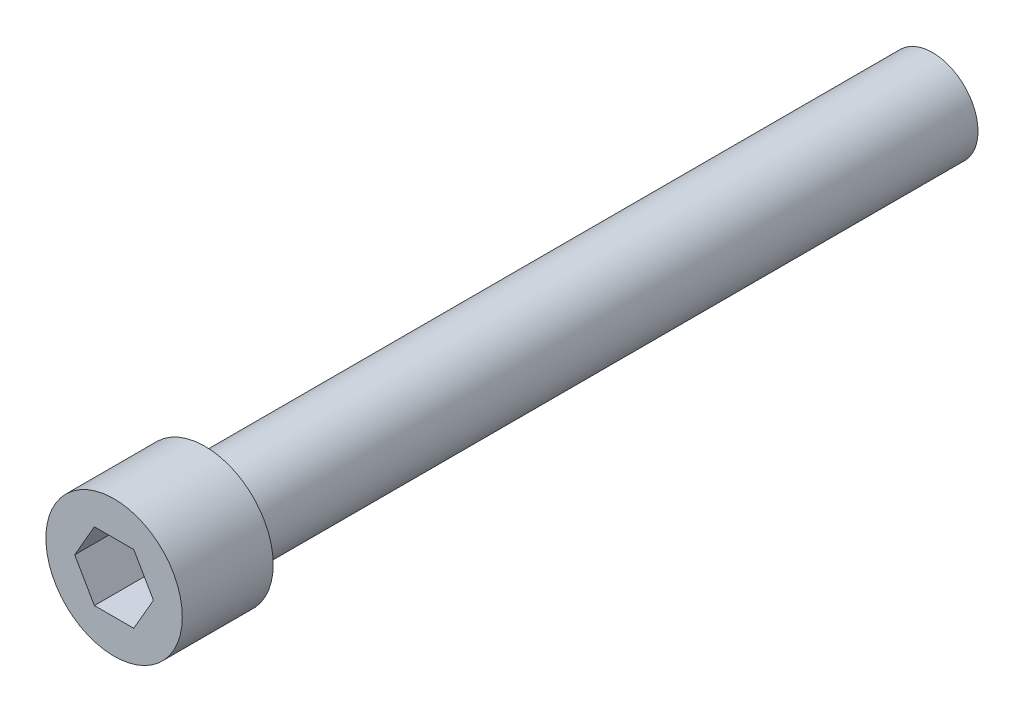
ISO-10303-21;
HEADER;
FILE_DESCRIPTION(('STEP AP214'),'2;1');
FILE_NAME('part.step','',(''),(''),'','','');
FILE_SCHEMA(('AUTOMOTIVE_DESIGN { 1 0 10303 214 1 1 1 1 }'));
ENDSEC;
DATA;
#1=APPLICATION_CONTEXT('core data for automotive mechanical design processes');
#2=APPLICATION_PROTOCOL_DEFINITION('international standard','automotive_design',2000,#1);
#3=PRODUCT_CONTEXT('',#1,'mechanical');
#4=PRODUCT('Part','Part','',(#3));
#5=PRODUCT_RELATED_PRODUCT_CATEGORY('part','',(#4));
#6=PRODUCT_DEFINITION_FORMATION('','',#4);
#7=PRODUCT_DEFINITION_CONTEXT('part definition',#1,'design');
#8=PRODUCT_DEFINITION('design','',#6,#7);
#9=PRODUCT_DEFINITION_SHAPE('','',#8);
#10=(LENGTH_UNIT() NAMED_UNIT(*) SI_UNIT(.MILLI.,.METRE.));
#11=(NAMED_UNIT(*) PLANE_ANGLE_UNIT() SI_UNIT($,.RADIAN.));
#12=(NAMED_UNIT(*) SI_UNIT($,.STERADIAN.) SOLID_ANGLE_UNIT());
#13=UNCERTAINTY_MEASURE_WITH_UNIT(LENGTH_MEASURE(1.E-05),#10,'distance_accuracy_value','');
#14=(GEOMETRIC_REPRESENTATION_CONTEXT(3) GLOBAL_UNCERTAINTY_ASSIGNED_CONTEXT((#13)) GLOBAL_UNIT_ASSIGNED_CONTEXT((#10,
#11,#12)) REPRESENTATION_CONTEXT('',''));
#15=CARTESIAN_POINT('',(0.,0.,0.));
#16=DIRECTION('',(0.,0.,1.));
#17=DIRECTION('',(1.,0.,0.));
#18=AXIS2_PLACEMENT_3D('',#15,#16,#17);
#19=CARTESIAN_POINT('',(0.,0.,50.8));
#20=DIRECTION('',(0.,0.,-1.));
#21=DIRECTION('',(-1.,0.,0.));
#22=AXIS2_PLACEMENT_3D('',#19,#20,#21);
#23=CYLINDRICAL_SURFACE('',#22,3.175);
#24=CARTESIAN_POINT('',(0.,0.,50.8));
#25=DIRECTION('',(0.,0.,1.));
#26=DIRECTION('',(1.,0.,0.));
#27=AXIS2_PLACEMENT_3D('',#24,#25,#26);
#28=CIRCLE('',#27,3.175);
#29=CARTESIAN_POINT('',(3.175,0.,50.8));
#30=VERTEX_POINT('',#29);
#31=EDGE_CURVE('E11',#30,#30,#28,.T.);
#32=ORIENTED_EDGE('',*,*,#31,.F.);
#33=EDGE_LOOP('',(#32));
#34=FACE_BOUND('',#33,.T.);
#35=CARTESIAN_POINT('',(0.,0.,0.));
#36=DIRECTION('',(0.,0.,1.));
#37=DIRECTION('',(1.,0.,0.));
#38=AXIS2_PLACEMENT_3D('',#35,#36,#37);
#39=CIRCLE('',#38,3.175);
#40=CARTESIAN_POINT('',(3.175,0.,0.));
#41=VERTEX_POINT('',#40);
#42=EDGE_CURVE('E36',#41,#41,#39,.T.);
#43=ORIENTED_EDGE('',*,*,#42,.T.);
#44=EDGE_LOOP('',(#43));
#45=FACE_BOUND('',#44,.T.);
#46=ADVANCED_FACE('F33',(#34,#45),#23,.T.);
#47=CARTESIAN_POINT('',(0.,0.,0.));
#48=DIRECTION('',(0.,0.,1.));
#49=DIRECTION('',(1.,0.,0.));
#50=AXIS2_PLACEMENT_3D('',#47,#48,#49);
#51=PLANE('',#50);
#52=ORIENTED_EDGE('',*,*,#42,.F.);
#53=EDGE_LOOP('',(#52));
#54=FACE_BOUND('',#53,.T.);
#55=ADVANCED_FACE('F151',(#54),#51,.F.);
#56=CARTESIAN_POINT('',(0.,0.,50.8));
#57=DIRECTION('',(0.,0.,1.));
#58=DIRECTION('',(1.,0.,0.));
#59=AXIS2_PLACEMENT_3D('',#56,#57,#58);
#60=PLANE('',#59);
#61=CARTESIAN_POINT('',(0.,0.,50.8));
#62=DIRECTION('',(0.,0.,1.));
#63=DIRECTION('',(1.,0.,0.));
#64=AXIS2_PLACEMENT_3D('',#61,#62,#63);
#65=CIRCLE('',#64,4.7625);
#66=CARTESIAN_POINT('',(4.7625,0.,50.8));
#67=VERTEX_POINT('',#66);
#68=EDGE_CURVE('E134',#67,#67,#65,.T.);
#69=ORIENTED_EDGE('',*,*,#68,.F.);
#70=EDGE_LOOP('',(#69));
#71=FACE_BOUND('',#70,.T.);
#72=ORIENTED_EDGE('',*,*,#31,.T.);
#73=EDGE_LOOP('',(#72));
#74=FACE_BOUND('',#73,.T.);
#75=ADVANCED_FACE('F148',(#71,#74),#60,.F.);
#76=CARTESIAN_POINT('',(0.,0.,57.15));
#77=DIRECTION('',(0.,0.,-1.));
#78=DIRECTION('',(-1.,0.,0.));
#79=AXIS2_PLACEMENT_3D('',#76,#77,#78);
#80=CYLINDRICAL_SURFACE('',#79,4.7625);
#81=CARTESIAN_POINT('',(0.,0.,57.15));
#82=DIRECTION('',(0.,0.,1.));
#83=DIRECTION('',(1.,0.,0.));
#84=AXIS2_PLACEMENT_3D('',#81,#82,#83);
#85=CIRCLE('',#84,4.7625);
#86=CARTESIAN_POINT('',(4.7625,0.,57.15));
#87=VERTEX_POINT('',#86);
#88=EDGE_CURVE('E140',#87,#87,#85,.T.);
#89=ORIENTED_EDGE('',*,*,#88,.F.);
#90=EDGE_LOOP('',(#89));
#91=FACE_BOUND('',#90,.T.);
#92=ORIENTED_EDGE('',*,*,#68,.T.);
#93=EDGE_LOOP('',(#92));
#94=FACE_BOUND('',#93,.T.);
#95=ADVANCED_FACE('F146',(#91,#94),#80,.T.);
#96=CARTESIAN_POINT('',(0.,0.,57.15));
#97=DIRECTION('',(0.,0.,1.));
#98=DIRECTION('',(1.,0.,0.));
#99=AXIS2_PLACEMENT_3D('',#96,#97,#98);
#100=PLANE('',#99);
#101=DIRECTION('',(0.5,0.866025403784439,0.));
#102=VECTOR('',#101,1.);
#103=CARTESIAN_POINT('',(1.3748153285078,-2.38125,57.15));
#104=LINE('',#103,#102);
#105=CARTESIAN_POINT('',(1.3748153285078,-2.38125,57.15));
#106=VERTEX_POINT('',#105);
#107=CARTESIAN_POINT('',(2.74963065701559,0.,57.15));
#108=VERTEX_POINT('',#107);
#109=EDGE_CURVE('E47',#106,#108,#104,.T.);
#110=ORIENTED_EDGE('',*,*,#109,.F.);
#111=DIRECTION('',(1.,0.,0.));
#112=VECTOR('',#111,1.);
#113=CARTESIAN_POINT('',(-1.3748153285078,-2.38125,57.15));
#114=LINE('',#113,#112);
#115=CARTESIAN_POINT('',(-1.3748153285078,-2.38125,57.15));
#116=VERTEX_POINT('',#115);
#117=EDGE_CURVE('E130',#116,#106,#114,.T.);
#118=ORIENTED_EDGE('',*,*,#117,.F.);
#119=DIRECTION('',(0.5,-0.866025403784439,0.));
#120=VECTOR('',#119,1.);
#121=CARTESIAN_POINT('',(-2.74963065701559,0.,57.15));
#122=LINE('',#121,#120);
#123=CARTESIAN_POINT('',(-2.74963065701559,0.,57.15));
#124=VERTEX_POINT('',#123);
#125=EDGE_CURVE('E128',#124,#116,#122,.T.);
#126=ORIENTED_EDGE('',*,*,#125,.F.);
#127=DIRECTION('',(-0.5,-0.866025403784439,0.));
#128=VECTOR('',#127,1.);
#129=CARTESIAN_POINT('',(-1.3748153285078,2.38125,57.15));
#130=LINE('',#129,#128);
#131=CARTESIAN_POINT('',(-1.3748153285078,2.38125,57.15));
#132=VERTEX_POINT('',#131);
#133=EDGE_CURVE('E95',#132,#124,#130,.T.);
#134=ORIENTED_EDGE('',*,*,#133,.F.);
#135=DIRECTION('',(-1.,0.,0.));
#136=VECTOR('',#135,1.);
#137=CARTESIAN_POINT('',(1.3748153285078,2.38125,57.15));
#138=LINE('',#137,#136);
#139=CARTESIAN_POINT('',(1.3748153285078,2.38125,57.15));
#140=VERTEX_POINT('',#139);
#141=EDGE_CURVE('E124',#140,#132,#138,.T.);
#142=ORIENTED_EDGE('',*,*,#141,.F.);
#143=DIRECTION('',(-0.5,0.866025403784439,0.));
#144=VECTOR('',#143,1.);
#145=CARTESIAN_POINT('',(2.74963065701559,0.,57.15));
#146=LINE('',#145,#144);
#147=EDGE_CURVE('E121',#108,#140,#146,.T.);
#148=ORIENTED_EDGE('',*,*,#147,.F.);
#149=EDGE_LOOP('',(#110,#118,#126,#134,#142,#148));
#150=FACE_BOUND('',#149,.T.);
#151=ORIENTED_EDGE('',*,*,#88,.T.);
#152=EDGE_LOOP('',(#151));
#153=FACE_BOUND('',#152,.T.);
#154=ADVANCED_FACE('F165',(#150,#153),#100,.T.);
#155=CARTESIAN_POINT('',(1.3748153285078,-2.38125,53.5686));
#156=DIRECTION('',(0.866025403784439,-0.5,0.));
#157=DIRECTION('',(0.5,0.866025403784439,0.));
#158=AXIS2_PLACEMENT_3D('',#155,#156,#157);
#159=PLANE('',#158);
#160=ORIENTED_EDGE('',*,*,#109,.T.);
#161=DIRECTION('',(0.,0.,1.));
#162=VECTOR('',#161,1.);
#163=CARTESIAN_POINT('',(2.74963065701559,0.,53.5686));
#164=LINE('',#163,#162);
#165=CARTESIAN_POINT('',(2.74963065701559,0.,53.5686));
#166=VERTEX_POINT('',#165);
#167=EDGE_CURVE('E77',#166,#108,#164,.T.);
#168=ORIENTED_EDGE('',*,*,#167,.F.);
#169=DIRECTION('',(0.5,0.866025403784439,0.));
#170=VECTOR('',#169,1.);
#171=CARTESIAN_POINT('',(1.3748153285078,-2.38125,53.5686));
#172=LINE('',#171,#170);
#173=CARTESIAN_POINT('',(1.3748153285078,-2.38125,53.5686));
#174=VERTEX_POINT('',#173);
#175=EDGE_CURVE('E132',#174,#166,#172,.T.);
#176=ORIENTED_EDGE('',*,*,#175,.F.);
#177=DIRECTION('',(0.,0.,1.));
#178=VECTOR('',#177,1.);
#179=CARTESIAN_POINT('',(1.3748153285078,-2.38125,53.5686));
#180=LINE('',#179,#178);
#181=EDGE_CURVE('E55',#174,#106,#180,.T.);
#182=ORIENTED_EDGE('',*,*,#181,.T.);
#183=EDGE_LOOP('',(#160,#168,#176,#182));
#184=FACE_BOUND('',#183,.T.);
#185=ADVANCED_FACE('F170',(#184),#159,.F.);
#186=CARTESIAN_POINT('',(-1.3748153285078,-2.38125,53.5686));
#187=DIRECTION('',(0.,-1.,0.));
#188=DIRECTION('',(1.,0.,0.));
#189=AXIS2_PLACEMENT_3D('',#186,#187,#188);
#190=PLANE('',#189);
#191=ORIENTED_EDGE('',*,*,#117,.T.);
#192=ORIENTED_EDGE('',*,*,#181,.F.);
#193=DIRECTION('',(1.,0.,0.));
#194=VECTOR('',#193,1.);
#195=CARTESIAN_POINT('',(-1.3748153285078,-2.38125,53.5686));
#196=LINE('',#195,#194);
#197=CARTESIAN_POINT('',(-1.3748153285078,-2.38125,53.5686));
#198=VERTEX_POINT('',#197);
#199=EDGE_CURVE('E107',#198,#174,#196,.T.);
#200=ORIENTED_EDGE('',*,*,#199,.F.);
#201=DIRECTION('',(0.,0.,1.));
#202=VECTOR('',#201,1.);
#203=CARTESIAN_POINT('',(-1.3748153285078,-2.38125,53.5686));
#204=LINE('',#203,#202);
#205=EDGE_CURVE('E99',#198,#116,#204,.T.);
#206=ORIENTED_EDGE('',*,*,#205,.T.);
#207=EDGE_LOOP('',(#191,#192,#200,#206));
#208=FACE_BOUND('',#207,.T.);
#209=ADVANCED_FACE('F174',(#208),#190,.F.);
#210=CARTESIAN_POINT('',(-2.74963065701559,0.,53.5686));
#211=DIRECTION('',(-0.866025403784439,-0.5,0.));
#212=DIRECTION('',(0.5,-0.866025403784439,0.));
#213=AXIS2_PLACEMENT_3D('',#210,#211,#212);
#214=PLANE('',#213);
#215=ORIENTED_EDGE('',*,*,#125,.T.);
#216=ORIENTED_EDGE('',*,*,#205,.F.);
#217=DIRECTION('',(0.5,-0.866025403784439,0.));
#218=VECTOR('',#217,1.);
#219=CARTESIAN_POINT('',(-2.74963065701559,0.,53.5686));
#220=LINE('',#219,#218);
#221=CARTESIAN_POINT('',(-2.74963065701559,0.,53.5686));
#222=VERTEX_POINT('',#221);
#223=EDGE_CURVE('E103',#222,#198,#220,.T.);
#224=ORIENTED_EDGE('',*,*,#223,.F.);
#225=DIRECTION('',(0.,0.,1.));
#226=VECTOR('',#225,1.);
#227=CARTESIAN_POINT('',(-2.74963065701559,0.,53.5686));
#228=LINE('',#227,#226);
#229=EDGE_CURVE('E88',#222,#124,#228,.T.);
#230=ORIENTED_EDGE('',*,*,#229,.T.);
#231=EDGE_LOOP('',(#215,#216,#224,#230));
#232=FACE_BOUND('',#231,.T.);
#233=ADVANCED_FACE('F104',(#232),#214,.F.);
#234=CARTESIAN_POINT('',(-1.3748153285078,2.38125,53.5686));
#235=DIRECTION('',(-0.866025403784439,0.5,0.));
#236=DIRECTION('',(-0.5,-0.866025403784439,0.));
#237=AXIS2_PLACEMENT_3D('',#234,#235,#236);
#238=PLANE('',#237);
#239=ORIENTED_EDGE('',*,*,#133,.T.);
#240=ORIENTED_EDGE('',*,*,#229,.F.);
#241=DIRECTION('',(-0.5,-0.866025403784439,0.));
#242=VECTOR('',#241,1.);
#243=CARTESIAN_POINT('',(-1.3748153285078,2.38125,53.5686));
#244=LINE('',#243,#242);
#245=CARTESIAN_POINT('',(-1.3748153285078,2.38125,53.5686));
#246=VERTEX_POINT('',#245);
#247=EDGE_CURVE('E92',#246,#222,#244,.T.);
#248=ORIENTED_EDGE('',*,*,#247,.F.);
#249=DIRECTION('',(0.,0.,1.));
#250=VECTOR('',#249,1.);
#251=CARTESIAN_POINT('',(-1.3748153285078,2.38125,53.5686));
#252=LINE('',#251,#250);
#253=EDGE_CURVE('E100',#246,#132,#252,.T.);
#254=ORIENTED_EDGE('',*,*,#253,.T.);
#255=EDGE_LOOP('',(#239,#240,#248,#254));
#256=FACE_BOUND('',#255,.T.);
#257=ADVANCED_FACE('F90',(#256),#238,.F.);
#258=CARTESIAN_POINT('',(1.3748153285078,2.38125,53.5686));
#259=DIRECTION('',(0.,1.,0.));
#260=DIRECTION('',(0.,0.,1.));
#261=AXIS2_PLACEMENT_3D('',#258,#259,#260);
#262=PLANE('',#261);
#263=ORIENTED_EDGE('',*,*,#141,.T.);
#264=ORIENTED_EDGE('',*,*,#253,.F.);
#265=DIRECTION('',(-1.,0.,0.));
#266=VECTOR('',#265,1.);
#267=CARTESIAN_POINT('',(1.3748153285078,2.38125,53.5686));
#268=LINE('',#267,#266);
#269=CARTESIAN_POINT('',(1.3748153285078,2.38125,53.5686));
#270=VERTEX_POINT('',#269);
#271=EDGE_CURVE('E113',#270,#246,#268,.T.);
#272=ORIENTED_EDGE('',*,*,#271,.F.);
#273=DIRECTION('',(0.,0.,1.));
#274=VECTOR('',#273,1.);
#275=CARTESIAN_POINT('',(1.3748153285078,2.38125,53.5686));
#276=LINE('',#275,#274);
#277=EDGE_CURVE('E137',#270,#140,#276,.T.);
#278=ORIENTED_EDGE('',*,*,#277,.T.);
#279=EDGE_LOOP('',(#263,#264,#272,#278));
#280=FACE_BOUND('',#279,.T.);
#281=ADVANCED_FACE('F178',(#280),#262,.F.);
#282=CARTESIAN_POINT('',(2.74963065701559,0.,53.5686));
#283=DIRECTION('',(0.866025403784439,0.5,0.));
#284=DIRECTION('',(-0.5,0.866025403784439,0.));
#285=AXIS2_PLACEMENT_3D('',#282,#283,#284);
#286=PLANE('',#285);
#287=ORIENTED_EDGE('',*,*,#147,.T.);
#288=ORIENTED_EDGE('',*,*,#277,.F.);
#289=DIRECTION('',(-0.5,0.866025403784439,0.));
#290=VECTOR('',#289,1.);
#291=CARTESIAN_POINT('',(2.74963065701559,0.,53.5686));
#292=LINE('',#291,#290);
#293=EDGE_CURVE('E115',#166,#270,#292,.T.);
#294=ORIENTED_EDGE('',*,*,#293,.F.);
#295=ORIENTED_EDGE('',*,*,#167,.T.);
#296=EDGE_LOOP('',(#287,#288,#294,#295));
#297=FACE_BOUND('',#296,.T.);
#298=ADVANCED_FACE('F175',(#297),#286,.F.);
#299=CARTESIAN_POINT('',(0.,0.,53.5686));
#300=DIRECTION('',(0.,0.,1.));
#301=DIRECTION('',(1.,0.,0.));
#302=AXIS2_PLACEMENT_3D('',#299,#300,#301);
#303=PLANE('',#302);
#304=ORIENTED_EDGE('',*,*,#175,.T.);
#305=ORIENTED_EDGE('',*,*,#293,.T.);
#306=ORIENTED_EDGE('',*,*,#271,.T.);
#307=ORIENTED_EDGE('',*,*,#247,.T.);
#308=ORIENTED_EDGE('',*,*,#223,.T.);
#309=ORIENTED_EDGE('',*,*,#199,.T.);
#310=EDGE_LOOP('',(#304,#305,#306,#307,#308,#309));
#311=FACE_BOUND('',#310,.T.);
#312=ADVANCED_FACE('F110',(#311),#303,.T.);
#313=CLOSED_SHELL('',(#46,#55,#75,#95,#154,#185,#209,#233,#257,#281,#298,#312));
#314=MANIFOLD_SOLID_BREP('B2',#313);
#315=ADVANCED_BREP_SHAPE_REPRESENTATION('',(#18,#314),#14);
#316=SHAPE_DEFINITION_REPRESENTATION(#9,#315);
ENDSEC;
END-ISO-10303-21;
